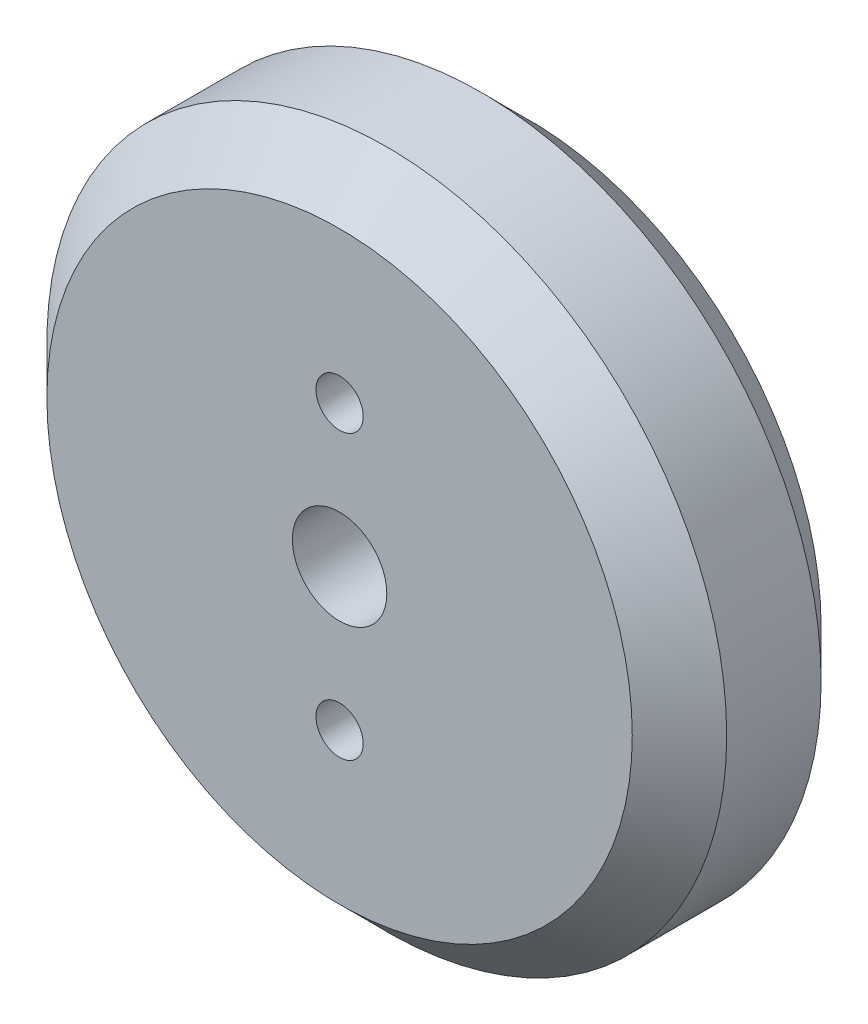
ISO-10303-21;
HEADER;
FILE_DESCRIPTION(('STEP AP214'),'2;1');
FILE_NAME('part.step','',(''),(''),'','','');
FILE_SCHEMA(('AUTOMOTIVE_DESIGN { 1 0 10303 214 1 1 1 1 }'));
ENDSEC;
DATA;
#1=APPLICATION_CONTEXT('core data for automotive mechanical design processes');
#2=APPLICATION_PROTOCOL_DEFINITION('international standard','automotive_design',2000,#1);
#3=PRODUCT_CONTEXT('',#1,'mechanical');
#4=PRODUCT('Part','Part','',(#3));
#5=PRODUCT_RELATED_PRODUCT_CATEGORY('part','',(#4));
#6=PRODUCT_DEFINITION_FORMATION('','',#4);
#7=PRODUCT_DEFINITION_CONTEXT('part definition',#1,'design');
#8=PRODUCT_DEFINITION('design','',#6,#7);
#9=PRODUCT_DEFINITION_SHAPE('','',#8);
#10=(LENGTH_UNIT() NAMED_UNIT(*) SI_UNIT(.MILLI.,.METRE.));
#11=(NAMED_UNIT(*) PLANE_ANGLE_UNIT() SI_UNIT($,.RADIAN.));
#12=(NAMED_UNIT(*) SI_UNIT($,.STERADIAN.) SOLID_ANGLE_UNIT());
#13=UNCERTAINTY_MEASURE_WITH_UNIT(LENGTH_MEASURE(1.E-05),#10,'distance_accuracy_value','');
#14=(GEOMETRIC_REPRESENTATION_CONTEXT(3) GLOBAL_UNCERTAINTY_ASSIGNED_CONTEXT((#13)) GLOBAL_UNIT_ASSIGNED_CONTEXT((#10,
#11,#12)) REPRESENTATION_CONTEXT('',''));
#15=CARTESIAN_POINT('',(0.,0.,0.));
#16=DIRECTION('',(0.,0.,1.));
#17=DIRECTION('',(1.,0.,0.));
#18=AXIS2_PLACEMENT_3D('',#15,#16,#17);
#19=CARTESIAN_POINT('',(0.,0.,20.));
#20=DIRECTION('',(0.,0.,1.));
#21=DIRECTION('',(1.,0.,0.));
#22=AXIS2_PLACEMENT_3D('',#19,#20,#21);
#23=PLANE('',#22);
#24=CARTESIAN_POINT('',(0.,0.,20.));
#25=DIRECTION('',(0.,0.,1.));
#26=DIRECTION('',(1.,0.,0.));
#27=AXIS2_PLACEMENT_3D('',#24,#25,#26);
#28=CIRCLE('',#27,31.);
#29=CARTESIAN_POINT('',(31.,0.,20.));
#30=VERTEX_POINT('',#29);
#31=EDGE_CURVE('E10',#30,#30,#28,.T.);
#32=ORIENTED_EDGE('',*,*,#31,.T.);
#33=EDGE_LOOP('',(#32));
#34=FACE_BOUND('',#33,.T.);
#35=CARTESIAN_POINT('',(0.,15.,20.));
#36=DIRECTION('',(0.,0.,1.));
#37=DIRECTION('',(1.,0.,0.));
#38=AXIS2_PLACEMENT_3D('',#35,#36,#37);
#39=CIRCLE('',#38,2.5);
#40=CARTESIAN_POINT('',(2.5,15.,20.));
#41=VERTEX_POINT('',#40);
#42=EDGE_CURVE('E55',#41,#41,#39,.T.);
#43=ORIENTED_EDGE('',*,*,#42,.F.);
#44=EDGE_LOOP('',(#43));
#45=FACE_BOUND('',#44,.T.);
#46=CARTESIAN_POINT('',(0.,0.,20.));
#47=DIRECTION('',(0.,0.,1.));
#48=DIRECTION('',(1.,0.,0.));
#49=AXIS2_PLACEMENT_3D('',#46,#47,#48);
#50=CIRCLE('',#49,5.);
#51=CARTESIAN_POINT('',(5.,0.,20.));
#52=VERTEX_POINT('',#51);
#53=EDGE_CURVE('E51',#52,#52,#50,.T.);
#54=ORIENTED_EDGE('',*,*,#53,.F.);
#55=EDGE_LOOP('',(#54));
#56=FACE_BOUND('',#55,.T.);
#57=CARTESIAN_POINT('',(0.,-15.,20.));
#58=DIRECTION('',(0.,0.,1.));
#59=DIRECTION('',(-1.,0.,0.));
#60=AXIS2_PLACEMENT_3D('',#57,#58,#59);
#61=CIRCLE('',#60,2.5);
#62=CARTESIAN_POINT('',(-2.5,-15.,20.));
#63=VERTEX_POINT('',#62);
#64=EDGE_CURVE('E61',#63,#63,#61,.T.);
#65=ORIENTED_EDGE('',*,*,#64,.F.);
#66=EDGE_LOOP('',(#65));
#67=FACE_BOUND('',#66,.T.);
#68=ADVANCED_FACE('F31',(#34,#45,#56,#67),#23,.T.);
#69=CARTESIAN_POINT('',(0.,0.,0.));
#70=DIRECTION('',(0.,0.,1.));
#71=DIRECTION('',(1.,0.,0.));
#72=AXIS2_PLACEMENT_3D('',#69,#70,#71);
#73=PLANE('',#72);
#74=CARTESIAN_POINT('',(0.,0.,0.));
#75=DIRECTION('',(0.,0.,1.));
#76=DIRECTION('',(1.,0.,0.));
#77=AXIS2_PLACEMENT_3D('',#74,#75,#76);
#78=CIRCLE('',#77,30.9999999999999);
#79=CARTESIAN_POINT('',(30.9999999999999,0.,0.));
#80=VERTEX_POINT('',#79);
#81=EDGE_CURVE('E38',#80,#80,#78,.F.);
#82=ORIENTED_EDGE('',*,*,#81,.T.);
#83=EDGE_LOOP('',(#82));
#84=FACE_BOUND('',#83,.T.);
#85=CARTESIAN_POINT('',(0.,0.,0.));
#86=DIRECTION('',(0.,0.,1.));
#87=DIRECTION('',(1.,0.,0.));
#88=AXIS2_PLACEMENT_3D('',#85,#86,#87);
#89=CIRCLE('',#88,5.);
#90=CARTESIAN_POINT('',(5.,0.,0.));
#91=VERTEX_POINT('',#90);
#92=EDGE_CURVE('E52',#91,#91,#89,.T.);
#93=ORIENTED_EDGE('',*,*,#92,.T.);
#94=EDGE_LOOP('',(#93));
#95=FACE_BOUND('',#94,.T.);
#96=CARTESIAN_POINT('',(0.,15.,0.));
#97=DIRECTION('',(0.,0.,1.));
#98=DIRECTION('',(1.,0.,0.));
#99=AXIS2_PLACEMENT_3D('',#96,#97,#98);
#100=CIRCLE('',#99,2.5);
#101=CARTESIAN_POINT('',(2.5,15.,0.));
#102=VERTEX_POINT('',#101);
#103=EDGE_CURVE('E58',#102,#102,#100,.T.);
#104=ORIENTED_EDGE('',*,*,#103,.T.);
#105=EDGE_LOOP('',(#104));
#106=FACE_BOUND('',#105,.T.);
#107=CARTESIAN_POINT('',(0.,-15.,0.));
#108=DIRECTION('',(0.,0.,1.));
#109=DIRECTION('',(-1.,0.,0.));
#110=AXIS2_PLACEMENT_3D('',#107,#108,#109);
#111=CIRCLE('',#110,2.5);
#112=CARTESIAN_POINT('',(-2.5,-15.,0.));
#113=VERTEX_POINT('',#112);
#114=EDGE_CURVE('E64',#113,#113,#111,.T.);
#115=ORIENTED_EDGE('',*,*,#114,.T.);
#116=EDGE_LOOP('',(#115));
#117=FACE_BOUND('',#116,.T.);
#118=ADVANCED_FACE('F74',(#84,#95,#106,#117),#73,.F.);
#119=CARTESIAN_POINT('',(0.,0.,20.));
#120=DIRECTION('',(0.,0.,-1.));
#121=DIRECTION('',(-1.,0.,0.));
#122=AXIS2_PLACEMENT_3D('',#119,#120,#121);
#123=CYLINDRICAL_SURFACE('',#122,36.);
#124=CARTESIAN_POINT('',(0.,0.,5.00000000000001));
#125=DIRECTION('',(0.,0.,1.));
#126=DIRECTION('',(1.,0.,0.));
#127=AXIS2_PLACEMENT_3D('',#124,#125,#126);
#128=CIRCLE('',#127,36.);
#129=CARTESIAN_POINT('',(36.,0.,5.00000000000001));
#130=VERTEX_POINT('',#129);
#131=EDGE_CURVE('E42',#130,#130,#128,.T.);
#132=ORIENTED_EDGE('',*,*,#131,.T.);
#133=EDGE_LOOP('',(#132));
#134=FACE_BOUND('',#133,.T.);
#135=CARTESIAN_POINT('',(0.,0.,15.));
#136=DIRECTION('',(0.,0.,1.));
#137=DIRECTION('',(1.,0.,0.));
#138=AXIS2_PLACEMENT_3D('',#135,#136,#137);
#139=CIRCLE('',#138,36.);
#140=CARTESIAN_POINT('',(36.,0.,15.));
#141=VERTEX_POINT('',#140);
#142=EDGE_CURVE('E46',#141,#141,#139,.F.);
#143=ORIENTED_EDGE('',*,*,#142,.T.);
#144=EDGE_LOOP('',(#143));
#145=FACE_BOUND('',#144,.T.);
#146=ADVANCED_FACE('F79',(#134,#145),#123,.T.);
#147=CARTESIAN_POINT('',(0.,0.,20.));
#148=DIRECTION('',(0.,0.,-1.));
#149=DIRECTION('',(-1.,0.,0.));
#150=AXIS2_PLACEMENT_3D('',#147,#148,#149);
#151=CYLINDRICAL_SURFACE('',#150,5.);
#152=ORIENTED_EDGE('',*,*,#53,.T.);
#153=EDGE_LOOP('',(#152));
#154=FACE_BOUND('',#153,.T.);
#155=ORIENTED_EDGE('',*,*,#92,.F.);
#156=EDGE_LOOP('',(#155));
#157=FACE_BOUND('',#156,.T.);
#158=ADVANCED_FACE('F83',(#154,#157),#151,.F.);
#159=CARTESIAN_POINT('',(0.,15.,20.));
#160=DIRECTION('',(0.,0.,-1.));
#161=DIRECTION('',(-1.,0.,0.));
#162=AXIS2_PLACEMENT_3D('',#159,#160,#161);
#163=CYLINDRICAL_SURFACE('',#162,2.5);
#164=ORIENTED_EDGE('',*,*,#42,.T.);
#165=EDGE_LOOP('',(#164));
#166=FACE_BOUND('',#165,.T.);
#167=ORIENTED_EDGE('',*,*,#103,.F.);
#168=EDGE_LOOP('',(#167));
#169=FACE_BOUND('',#168,.T.);
#170=ADVANCED_FACE('F96',(#166,#169),#163,.F.);
#171=CARTESIAN_POINT('',(0.,-15.,20.));
#172=DIRECTION('',(0.,0.,-1.));
#173=DIRECTION('',(-1.,0.,0.));
#174=AXIS2_PLACEMENT_3D('',#171,#172,#173);
#175=CYLINDRICAL_SURFACE('',#174,2.5);
#176=ORIENTED_EDGE('',*,*,#64,.T.);
#177=EDGE_LOOP('',(#176));
#178=FACE_BOUND('',#177,.T.);
#179=ORIENTED_EDGE('',*,*,#114,.F.);
#180=EDGE_LOOP('',(#179));
#181=FACE_BOUND('',#180,.T.);
#182=ADVANCED_FACE('F70',(#178,#181),#175,.F.);
#183=CARTESIAN_POINT('',(0.,0.,5.00000000000001));
#184=DIRECTION('',(0.,0.,1.));
#185=DIRECTION('',(1.,0.,0.));
#186=AXIS2_PLACEMENT_3D('',#183,#184,#185);
#187=CONICAL_SURFACE('',#186,36.,0.78539816339745);
#188=ORIENTED_EDGE('',*,*,#81,.F.);
#189=EDGE_LOOP('',(#188));
#190=FACE_BOUND('',#189,.T.);
#191=ORIENTED_EDGE('',*,*,#131,.F.);
#192=EDGE_LOOP('',(#191));
#193=FACE_BOUND('',#192,.T.);
#194=ADVANCED_FACE('F88',(#190,#193),#187,.T.);
#195=CARTESIAN_POINT('',(0.,0.,20.));
#196=DIRECTION('',(0.,0.,-1.));
#197=DIRECTION('',(-1.,0.,0.));
#198=AXIS2_PLACEMENT_3D('',#195,#196,#197);
#199=CONICAL_SURFACE('',#198,31.,0.785398163397447);
#200=ORIENTED_EDGE('',*,*,#142,.F.);
#201=EDGE_LOOP('',(#200));
#202=FACE_BOUND('',#201,.T.);
#203=ORIENTED_EDGE('',*,*,#31,.F.);
#204=EDGE_LOOP('',(#203));
#205=FACE_BOUND('',#204,.T.);
#206=ADVANCED_FACE('F33',(#202,#205),#199,.T.);
#207=CLOSED_SHELL('',(#68,#118,#146,#158,#170,#182,#194,#206));
#208=MANIFOLD_SOLID_BREP('B2',#207);
#209=ADVANCED_BREP_SHAPE_REPRESENTATION('',(#18,#208),#14);
#210=SHAPE_DEFINITION_REPRESENTATION(#9,#209);
ENDSEC;
END-ISO-10303-21;
